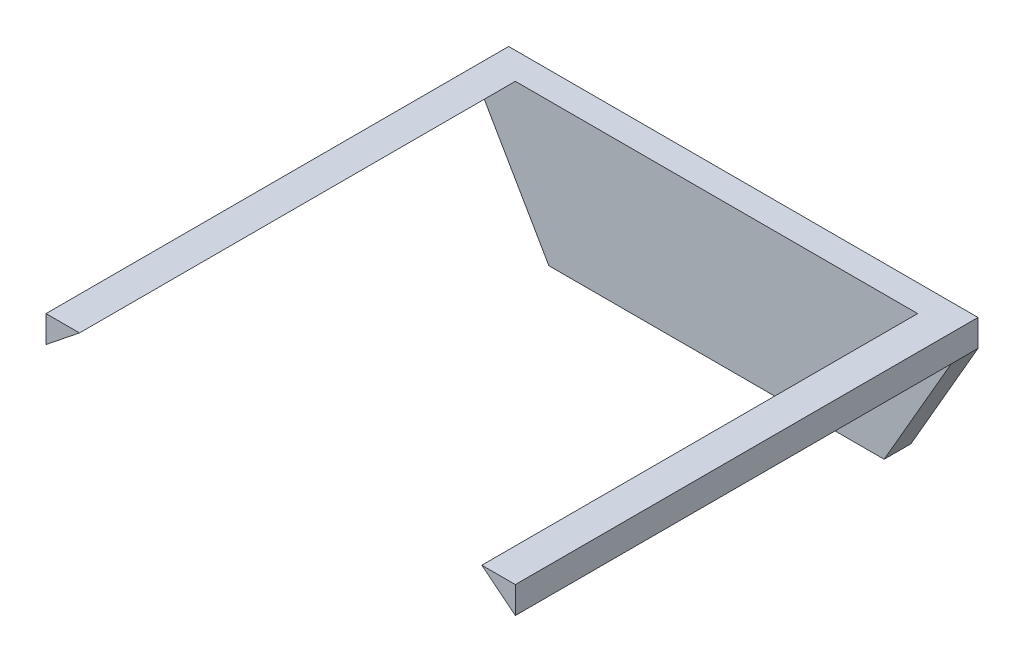
ISO-10303-21;
HEADER;
FILE_DESCRIPTION(('STEP AP214'),'2;1');
FILE_NAME('part.step','',(''),(''),'','','');
FILE_SCHEMA(('AUTOMOTIVE_DESIGN { 1 0 10303 214 1 1 1 1 }'));
ENDSEC;
DATA;
#1=APPLICATION_CONTEXT('core data for automotive mechanical design processes');
#2=APPLICATION_PROTOCOL_DEFINITION('international standard','automotive_design',2000,#1);
#3=PRODUCT_CONTEXT('',#1,'mechanical');
#4=PRODUCT('Part','Part','',(#3));
#5=PRODUCT_RELATED_PRODUCT_CATEGORY('part','',(#4));
#6=PRODUCT_DEFINITION_FORMATION('','',#4);
#7=PRODUCT_DEFINITION_CONTEXT('part definition',#1,'design');
#8=PRODUCT_DEFINITION('design','',#6,#7);
#9=PRODUCT_DEFINITION_SHAPE('','',#8);
#10=(LENGTH_UNIT() NAMED_UNIT(*) SI_UNIT(.MILLI.,.METRE.));
#11=(NAMED_UNIT(*) PLANE_ANGLE_UNIT() SI_UNIT($,.RADIAN.));
#12=(NAMED_UNIT(*) SI_UNIT($,.STERADIAN.) SOLID_ANGLE_UNIT());
#13=UNCERTAINTY_MEASURE_WITH_UNIT(LENGTH_MEASURE(1.E-05),#10,'distance_accuracy_value','');
#14=(GEOMETRIC_REPRESENTATION_CONTEXT(3) GLOBAL_UNCERTAINTY_ASSIGNED_CONTEXT((#13)) GLOBAL_UNIT_ASSIGNED_CONTEXT((#10,
#11,#12)) REPRESENTATION_CONTEXT('',''));
#15=CARTESIAN_POINT('',(0.,0.,0.));
#16=DIRECTION('',(0.,0.,1.));
#17=DIRECTION('',(1.,0.,0.));
#18=AXIS2_PLACEMENT_3D('',#15,#16,#17);
#19=CARTESIAN_POINT('',(0.,0.,5.08));
#20=DIRECTION('',(0.,0.,-1.));
#21=DIRECTION('',(-1.,0.,0.));
#22=AXIS2_PLACEMENT_3D('',#19,#20,#21);
#23=PLANE('',#22);
#24=DIRECTION('',(0.78086880944303,-0.624695047554424,0.));
#25=VECTOR('',#24,1.);
#26=CARTESIAN_POINT('',(6.3500000000001,27.0770452561247,5.08));
#27=LINE('',#26,#25);
#28=CARTESIAN_POINT('',(6.3500000000001,27.0770452561247,5.08));
#29=VERTEX_POINT('',#28);
#30=CARTESIAN_POINT('',(12.7000000000001,21.9970452561247,5.08));
#31=VERTEX_POINT('',#30);
#32=EDGE_CURVE('E134',#29,#31,#27,.T.);
#33=ORIENTED_EDGE('',*,*,#32,.F.);
#34=DIRECTION('',(-1.,0.,0.));
#35=VECTOR('',#34,1.);
#36=CARTESIAN_POINT('',(-76.2,27.0770452561248,5.08));
#37=LINE('',#36,#35);
#38=CARTESIAN_POINT('',(-69.85,27.0770452561247,5.08));
#39=VERTEX_POINT('',#38);
#40=EDGE_CURVE('E37',#29,#39,#37,.T.);
#41=ORIENTED_EDGE('',*,*,#40,.T.);
#42=DIRECTION('',(0.780868809443034,0.62469504755442,0.));
#43=VECTOR('',#42,1.);
#44=CARTESIAN_POINT('',(-76.1999999999999,21.9970452561248,5.08));
#45=LINE('',#44,#43);
#46=CARTESIAN_POINT('',(-76.1999999999999,21.9970452561248,5.08));
#47=VERTEX_POINT('',#46);
#48=EDGE_CURVE('E137',#47,#39,#45,.T.);
#49=ORIENTED_EDGE('',*,*,#48,.F.);
#50=DIRECTION('',(0.499999999999998,-0.86602540378444,0.));
#51=VECTOR('',#50,1.);
#52=CARTESIAN_POINT('',(-63.5,0.,5.08));
#53=LINE('',#52,#51);
#54=CARTESIAN_POINT('',(-63.5,0.,5.08));
#55=VERTEX_POINT('',#54);
#56=EDGE_CURVE('E203',#47,#55,#53,.T.);
#57=ORIENTED_EDGE('',*,*,#56,.T.);
#58=DIRECTION('',(1.,0.,0.));
#59=VECTOR('',#58,1.);
#60=CARTESIAN_POINT('',(0.,0.,5.08));
#61=LINE('',#60,#59);
#62=CARTESIAN_POINT('',(0.,0.,5.08));
#63=VERTEX_POINT('',#62);
#64=EDGE_CURVE('E53',#55,#63,#61,.T.);
#65=ORIENTED_EDGE('',*,*,#64,.T.);
#66=DIRECTION('',(0.500000000000004,0.866025403784436,0.));
#67=VECTOR('',#66,1.);
#68=CARTESIAN_POINT('',(0.,0.,5.08));
#69=LINE('',#68,#67);
#70=EDGE_CURVE('E88',#63,#31,#69,.T.);
#71=ORIENTED_EDGE('',*,*,#70,.T.);
#72=EDGE_LOOP('',(#33,#41,#49,#57,#65,#71));
#73=FACE_BOUND('',#72,.T.);
#74=ADVANCED_FACE('F33',(#73),#23,.F.);
#75=CARTESIAN_POINT('',(0.,0.,5.08));
#76=DIRECTION('',(-0.866025403784436,0.500000000000004,0.));
#77=DIRECTION('',(-0.500000000000004,-0.866025403784436,0.));
#78=AXIS2_PLACEMENT_3D('',#75,#76,#77);
#79=PLANE('',#78);
#80=DIRECTION('',(0.500000000000004,0.866025403784436,0.));
#81=VECTOR('',#80,1.);
#82=CARTESIAN_POINT('',(0.,0.,0.));
#83=LINE('',#82,#81);
#84=CARTESIAN_POINT('',(0.,0.,0.));
#85=VERTEX_POINT('',#84);
#86=CARTESIAN_POINT('',(12.7000000000001,21.9970452561247,0.));
#87=VERTEX_POINT('',#86);
#88=EDGE_CURVE('E166',#85,#87,#83,.T.);
#89=ORIENTED_EDGE('',*,*,#88,.T.);
#90=DIRECTION('',(0.,0.,-1.));
#91=VECTOR('',#90,1.);
#92=CARTESIAN_POINT('',(12.7000000000001,21.9970452561247,5.08));
#93=LINE('',#92,#91);
#94=EDGE_CURVE('E11',#31,#87,#93,.T.);
#95=ORIENTED_EDGE('',*,*,#94,.F.);
#96=ORIENTED_EDGE('',*,*,#70,.F.);
#97=DIRECTION('',(0.,0.,-1.));
#98=VECTOR('',#97,1.);
#99=CARTESIAN_POINT('',(0.,0.,5.08));
#100=LINE('',#99,#98);
#101=EDGE_CURVE('E184',#63,#85,#100,.T.);
#102=ORIENTED_EDGE('',*,*,#101,.T.);
#103=EDGE_LOOP('',(#89,#95,#96,#102));
#104=FACE_BOUND('',#103,.T.);
#105=ADVANCED_FACE('F35',(#104),#79,.F.);
#106=CARTESIAN_POINT('',(12.7000000000001,21.9970452561247,5.08));
#107=DIRECTION('',(-1.,0.,0.));
#108=DIRECTION('',(0.,-1.,0.));
#109=AXIS2_PLACEMENT_3D('',#106,#107,#108);
#110=PLANE('',#109);
#111=DIRECTION('',(0.,1.,0.));
#112=VECTOR('',#111,1.);
#113=CARTESIAN_POINT('',(12.7000000000001,21.9970452561247,0.));
#114=LINE('',#113,#112);
#115=CARTESIAN_POINT('',(12.7000000000001,27.0770452561247,0.));
#116=VERTEX_POINT('',#115);
#117=EDGE_CURVE('E170',#87,#116,#114,.T.);
#118=ORIENTED_EDGE('',*,*,#117,.T.);
#119=DIRECTION('',(0.,0.,-1.));
#120=VECTOR('',#119,1.);
#121=CARTESIAN_POINT('',(12.7000000000001,27.0770452561247,5.08));
#122=LINE('',#121,#120);
#123=CARTESIAN_POINT('',(12.7000000000001,27.0770452561247,87.63));
#124=VERTEX_POINT('',#123);
#125=EDGE_CURVE('E44',#124,#116,#122,.T.);
#126=ORIENTED_EDGE('',*,*,#125,.F.);
#127=DIRECTION('',(0.,1.,0.));
#128=VECTOR('',#127,1.);
#129=CARTESIAN_POINT('',(12.7000000000001,21.9970452561247,87.63));
#130=LINE('',#129,#128);
#131=CARTESIAN_POINT('',(12.7000000000001,21.9970452561247,87.63));
#132=VERTEX_POINT('',#131);
#133=EDGE_CURVE('E117',#132,#124,#130,.T.);
#134=ORIENTED_EDGE('',*,*,#133,.F.);
#135=DIRECTION('',(0.,0.,-1.));
#136=VECTOR('',#135,1.);
#137=CARTESIAN_POINT('',(12.7000000000001,21.9970452561247,87.63));
#138=LINE('',#137,#136);
#139=EDGE_CURVE('E121',#132,#31,#138,.T.);
#140=ORIENTED_EDGE('',*,*,#139,.T.);
#141=ORIENTED_EDGE('',*,*,#94,.T.);
#142=EDGE_LOOP('',(#118,#126,#134,#140,#141));
#143=FACE_BOUND('',#142,.T.);
#144=ADVANCED_FACE('F119',(#143),#110,.F.);
#145=CARTESIAN_POINT('',(-76.2,27.0770452561248,5.08));
#146=DIRECTION('',(0.,-1.,0.));
#147=DIRECTION('',(1.,0.,0.));
#148=AXIS2_PLACEMENT_3D('',#145,#146,#147);
#149=PLANE('',#148);
#150=DIRECTION('',(-1.,0.,0.));
#151=VECTOR('',#150,1.);
#152=CARTESIAN_POINT('',(-76.2,27.0770452561248,0.));
#153=LINE('',#152,#151);
#154=CARTESIAN_POINT('',(-76.2,27.0770452561248,0.));
#155=VERTEX_POINT('',#154);
#156=EDGE_CURVE('E174',#116,#155,#153,.T.);
#157=ORIENTED_EDGE('',*,*,#156,.T.);
#158=DIRECTION('',(0.,0.,-1.));
#159=VECTOR('',#158,1.);
#160=CARTESIAN_POINT('',(-76.2,27.0770452561248,5.08));
#161=LINE('',#160,#159);
#162=CARTESIAN_POINT('',(-76.2,27.0770452561248,87.63));
#163=VERTEX_POINT('',#162);
#164=EDGE_CURVE('E190',#163,#155,#161,.T.);
#165=ORIENTED_EDGE('',*,*,#164,.F.);
#166=DIRECTION('',(-1.,0.,0.));
#167=VECTOR('',#166,1.);
#168=CARTESIAN_POINT('',(-76.2,27.0770452561248,87.63));
#169=LINE('',#168,#167);
#170=CARTESIAN_POINT('',(-69.85,27.0770452561247,87.63));
#171=VERTEX_POINT('',#170);
#172=EDGE_CURVE('E150',#171,#163,#169,.T.);
#173=ORIENTED_EDGE('',*,*,#172,.F.);
#174=DIRECTION('',(0.,0.,-1.));
#175=VECTOR('',#174,1.);
#176=CARTESIAN_POINT('',(-69.85,27.0770452561247,87.63));
#177=LINE('',#176,#175);
#178=EDGE_CURVE('E153',#171,#39,#177,.T.);
#179=ORIENTED_EDGE('',*,*,#178,.T.);
#180=ORIENTED_EDGE('',*,*,#40,.F.);
#181=DIRECTION('',(0.,0.,-1.));
#182=VECTOR('',#181,1.);
#183=CARTESIAN_POINT('',(6.3500000000001,27.0770452561247,87.63));
#184=LINE('',#183,#182);
#185=CARTESIAN_POINT('',(6.3500000000001,27.0770452561247,87.63));
#186=VERTEX_POINT('',#185);
#187=EDGE_CURVE('E138',#186,#29,#184,.T.);
#188=ORIENTED_EDGE('',*,*,#187,.F.);
#189=DIRECTION('',(-1.,0.,0.));
#190=VECTOR('',#189,1.);
#191=CARTESIAN_POINT('',(12.7000000000001,27.0770452561247,87.63));
#192=LINE('',#191,#190);
#193=EDGE_CURVE('E126',#124,#186,#192,.T.);
#194=ORIENTED_EDGE('',*,*,#193,.F.);
#195=ORIENTED_EDGE('',*,*,#125,.T.);
#196=EDGE_LOOP('',(#157,#165,#173,#179,#180,#188,#194,#195));
#197=FACE_BOUND('',#196,.T.);
#198=ADVANCED_FACE('F193',(#197),#149,.F.);
#199=CARTESIAN_POINT('',(-76.1999999999999,21.9970452561248,5.08));
#200=DIRECTION('',(1.,0.,0.));
#201=DIRECTION('',(0.,1.,0.));
#202=AXIS2_PLACEMENT_3D('',#199,#200,#201);
#203=PLANE('',#202);
#204=DIRECTION('',(0.,-1.,0.));
#205=VECTOR('',#204,1.);
#206=CARTESIAN_POINT('',(-76.1999999999999,21.9970452561248,0.));
#207=LINE('',#206,#205);
#208=CARTESIAN_POINT('',(-76.1999999999999,21.9970452561248,0.));
#209=VERTEX_POINT('',#208);
#210=EDGE_CURVE('E180',#155,#209,#207,.T.);
#211=ORIENTED_EDGE('',*,*,#210,.T.);
#212=DIRECTION('',(0.,0.,-1.));
#213=VECTOR('',#212,1.);
#214=CARTESIAN_POINT('',(-76.1999999999999,21.9970452561248,5.08));
#215=LINE('',#214,#213);
#216=EDGE_CURVE('E188',#47,#209,#215,.T.);
#217=ORIENTED_EDGE('',*,*,#216,.F.);
#218=DIRECTION('',(0.,0.,-1.));
#219=VECTOR('',#218,1.);
#220=CARTESIAN_POINT('',(-76.1999999999999,21.9970452561248,87.63));
#221=LINE('',#220,#219);
#222=CARTESIAN_POINT('',(-76.1999999999999,21.9970452561248,87.63));
#223=VERTEX_POINT('',#222);
#224=EDGE_CURVE('E156',#223,#47,#221,.T.);
#225=ORIENTED_EDGE('',*,*,#224,.F.);
#226=DIRECTION('',(0.,-1.,0.));
#227=VECTOR('',#226,1.);
#228=CARTESIAN_POINT('',(-76.1999999999999,21.9970452561248,87.63));
#229=LINE('',#228,#227);
#230=EDGE_CURVE('E141',#163,#223,#229,.T.);
#231=ORIENTED_EDGE('',*,*,#230,.F.);
#232=ORIENTED_EDGE('',*,*,#164,.T.);
#233=EDGE_LOOP('',(#211,#217,#225,#231,#232));
#234=FACE_BOUND('',#233,.T.);
#235=ADVANCED_FACE('F199',(#234),#203,.F.);
#236=CARTESIAN_POINT('',(-63.5,0.,5.08));
#237=DIRECTION('',(0.86602540378444,0.499999999999998,0.));
#238=DIRECTION('',(-0.499999999999998,0.86602540378444,0.));
#239=AXIS2_PLACEMENT_3D('',#236,#237,#238);
#240=PLANE('',#239);
#241=DIRECTION('',(0.499999999999998,-0.86602540378444,0.));
#242=VECTOR('',#241,1.);
#243=CARTESIAN_POINT('',(-63.5,0.,0.));
#244=LINE('',#243,#242);
#245=CARTESIAN_POINT('',(-63.5,0.,0.));
#246=VERTEX_POINT('',#245);
#247=EDGE_CURVE('E77',#209,#246,#244,.T.);
#248=ORIENTED_EDGE('',*,*,#247,.T.);
#249=DIRECTION('',(0.,0.,-1.));
#250=VECTOR('',#249,1.);
#251=CARTESIAN_POINT('',(-63.5,0.,5.08));
#252=LINE('',#251,#250);
#253=EDGE_CURVE('E186',#55,#246,#252,.T.);
#254=ORIENTED_EDGE('',*,*,#253,.F.);
#255=ORIENTED_EDGE('',*,*,#56,.F.);
#256=ORIENTED_EDGE('',*,*,#216,.T.);
#257=EDGE_LOOP('',(#248,#254,#255,#256));
#258=FACE_BOUND('',#257,.T.);
#259=ADVANCED_FACE('F202',(#258),#240,.F.);
#260=CARTESIAN_POINT('',(0.,0.,5.08));
#261=DIRECTION('',(0.,1.,0.));
#262=DIRECTION('',(-1.,0.,0.));
#263=AXIS2_PLACEMENT_3D('',#260,#261,#262);
#264=PLANE('',#263);
#265=DIRECTION('',(1.,0.,0.));
#266=VECTOR('',#265,1.);
#267=CARTESIAN_POINT('',(0.,0.,0.));
#268=LINE('',#267,#266);
#269=EDGE_CURVE('E83',#246,#85,#268,.T.);
#270=ORIENTED_EDGE('',*,*,#269,.T.);
#271=ORIENTED_EDGE('',*,*,#101,.F.);
#272=ORIENTED_EDGE('',*,*,#64,.F.);
#273=ORIENTED_EDGE('',*,*,#253,.T.);
#274=EDGE_LOOP('',(#270,#271,#272,#273));
#275=FACE_BOUND('',#274,.T.);
#276=ADVANCED_FACE('F224',(#275),#264,.F.);
#277=CARTESIAN_POINT('',(0.,0.,0.));
#278=DIRECTION('',(0.,0.,-1.));
#279=DIRECTION('',(-1.,0.,0.));
#280=AXIS2_PLACEMENT_3D('',#277,#278,#279);
#281=PLANE('',#280);
#282=ORIENTED_EDGE('',*,*,#88,.F.);
#283=ORIENTED_EDGE('',*,*,#269,.F.);
#284=ORIENTED_EDGE('',*,*,#247,.F.);
#285=ORIENTED_EDGE('',*,*,#210,.F.);
#286=ORIENTED_EDGE('',*,*,#156,.F.);
#287=ORIENTED_EDGE('',*,*,#117,.F.);
#288=EDGE_LOOP('',(#282,#283,#284,#285,#286,#287));
#289=FACE_BOUND('',#288,.T.);
#290=ADVANCED_FACE('F196',(#289),#281,.T.);
#291=CARTESIAN_POINT('',(-76.1999999999999,21.9970452561248,87.63));
#292=DIRECTION('',(-0.62469504755442,0.780868809443034,0.));
#293=DIRECTION('',(-0.780868809443034,-0.62469504755442,0.));
#294=AXIS2_PLACEMENT_3D('',#291,#292,#293);
#295=PLANE('',#294);
#296=ORIENTED_EDGE('',*,*,#48,.T.);
#297=ORIENTED_EDGE('',*,*,#178,.F.);
#298=DIRECTION('',(0.780868809443034,0.62469504755442,0.));
#299=VECTOR('',#298,1.);
#300=CARTESIAN_POINT('',(-76.1999999999999,21.9970452561248,87.63));
#301=LINE('',#300,#299);
#302=EDGE_CURVE('E148',#223,#171,#301,.T.);
#303=ORIENTED_EDGE('',*,*,#302,.F.);
#304=ORIENTED_EDGE('',*,*,#224,.T.);
#305=EDGE_LOOP('',(#296,#297,#303,#304));
#306=FACE_BOUND('',#305,.T.);
#307=ADVANCED_FACE('F205',(#306),#295,.F.);
#308=CARTESIAN_POINT('',(0.,0.,87.63));
#309=DIRECTION('',(0.,0.,-1.));
#310=DIRECTION('',(-1.,0.,0.));
#311=AXIS2_PLACEMENT_3D('',#308,#309,#310);
#312=PLANE('',#311);
#313=ORIENTED_EDGE('',*,*,#230,.T.);
#314=ORIENTED_EDGE('',*,*,#302,.T.);
#315=ORIENTED_EDGE('',*,*,#172,.T.);
#316=EDGE_LOOP('',(#313,#314,#315));
#317=FACE_BOUND('',#316,.T.);
#318=ADVANCED_FACE('F207',(#317),#312,.F.);
#319=CARTESIAN_POINT('',(6.3500000000001,27.0770452561247,87.63));
#320=DIRECTION('',(0.624695047554424,0.78086880944303,0.));
#321=DIRECTION('',(-0.78086880944303,0.624695047554424,0.));
#322=AXIS2_PLACEMENT_3D('',#319,#320,#321);
#323=PLANE('',#322);
#324=ORIENTED_EDGE('',*,*,#32,.T.);
#325=ORIENTED_EDGE('',*,*,#139,.F.);
#326=DIRECTION('',(0.78086880944303,-0.624695047554424,0.));
#327=VECTOR('',#326,1.);
#328=CARTESIAN_POINT('',(6.3500000000001,27.0770452561247,87.63));
#329=LINE('',#328,#327);
#330=EDGE_CURVE('E127',#186,#132,#329,.T.);
#331=ORIENTED_EDGE('',*,*,#330,.F.);
#332=ORIENTED_EDGE('',*,*,#187,.T.);
#333=EDGE_LOOP('',(#324,#325,#331,#332));
#334=FACE_BOUND('',#333,.T.);
#335=ADVANCED_FACE('F136',(#334),#323,.F.);
#336=CARTESIAN_POINT('',(0.,0.,87.63));
#337=DIRECTION('',(0.,0.,1.));
#338=DIRECTION('',(1.,0.,0.));
#339=AXIS2_PLACEMENT_3D('',#336,#337,#338);
#340=PLANE('',#339);
#341=ORIENTED_EDGE('',*,*,#330,.T.);
#342=ORIENTED_EDGE('',*,*,#133,.T.);
#343=ORIENTED_EDGE('',*,*,#193,.T.);
#344=EDGE_LOOP('',(#341,#342,#343));
#345=FACE_BOUND('',#344,.T.);
#346=ADVANCED_FACE('F130',(#345),#340,.T.);
#347=CLOSED_SHELL('',(#74,#105,#144,#198,#235,#259,#276,#290,#307,#318,#335,#346));
#348=MANIFOLD_SOLID_BREP('B2',#347);
#349=ADVANCED_BREP_SHAPE_REPRESENTATION('',(#18,#348),#14);
#350=SHAPE_DEFINITION_REPRESENTATION(#9,#349);
ENDSEC;
END-ISO-10303-21;
